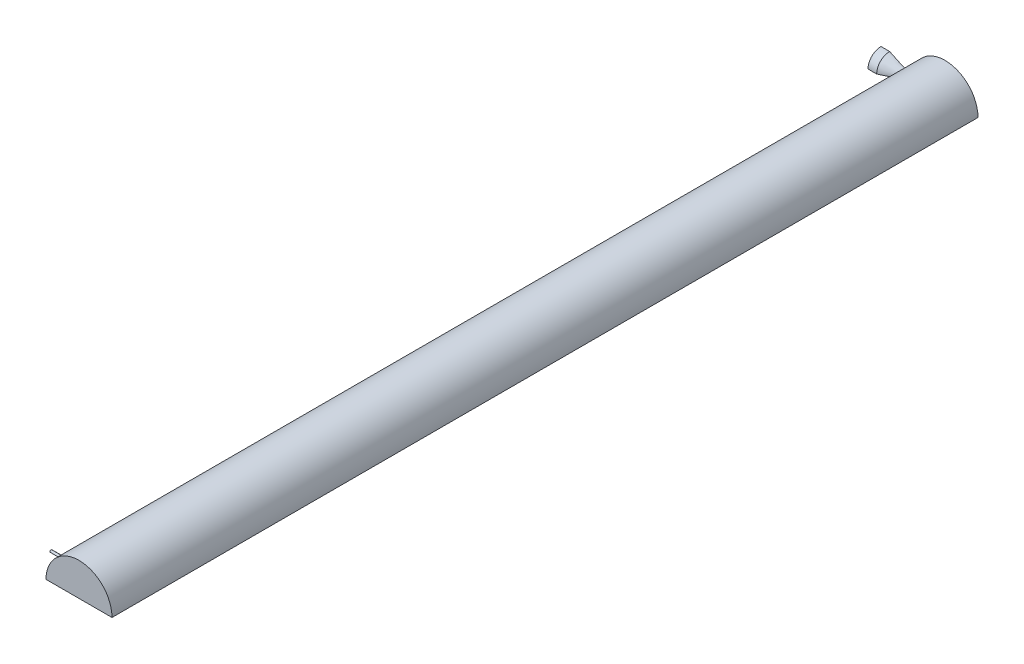
ISO-10303-21;
HEADER;
FILE_DESCRIPTION(('STEP AP214'),'2;1');
FILE_NAME('part.step','',(''),(''),'','','');
FILE_SCHEMA(('AUTOMOTIVE_DESIGN { 1 0 10303 214 1 1 1 1 }'));
ENDSEC;
DATA;
#1=APPLICATION_CONTEXT('core data for automotive mechanical design processes');
#2=APPLICATION_PROTOCOL_DEFINITION('international standard','automotive_design',2000,#1);
#3=PRODUCT_CONTEXT('',#1,'mechanical');
#4=PRODUCT('Part','Part','',(#3));
#5=PRODUCT_RELATED_PRODUCT_CATEGORY('part','',(#4));
#6=PRODUCT_DEFINITION_FORMATION('','',#4);
#7=PRODUCT_DEFINITION_CONTEXT('part definition',#1,'design');
#8=PRODUCT_DEFINITION('design','',#6,#7);
#9=PRODUCT_DEFINITION_SHAPE('','',#8);
#10=(LENGTH_UNIT() NAMED_UNIT(*) SI_UNIT(.MILLI.,.METRE.));
#11=(NAMED_UNIT(*) PLANE_ANGLE_UNIT() SI_UNIT($,.RADIAN.));
#12=(NAMED_UNIT(*) SI_UNIT($,.STERADIAN.) SOLID_ANGLE_UNIT());
#13=UNCERTAINTY_MEASURE_WITH_UNIT(LENGTH_MEASURE(1.E-05),#10,'distance_accuracy_value','');
#14=(GEOMETRIC_REPRESENTATION_CONTEXT(3) GLOBAL_UNCERTAINTY_ASSIGNED_CONTEXT((#13)) GLOBAL_UNIT_ASSIGNED_CONTEXT((#10,
#11,#12)) REPRESENTATION_CONTEXT('',''));
#15=CARTESIAN_POINT('',(0.,0.,0.));
#16=DIRECTION('',(0.,0.,1.));
#17=DIRECTION('',(1.,0.,0.));
#18=AXIS2_PLACEMENT_3D('',#15,#16,#17);
#19=CARTESIAN_POINT('',(-10.6541824341614,0.,15.0199999998294));
#20=DIRECTION('',(1.,0.,0.));
#21=DIRECTION('',(0.,1.,0.));
#22=AXIS2_PLACEMENT_3D('',#19,#20,#21);
#23=PLANE('',#22);
#24=CARTESIAN_POINT('',(-10.6541824341614,0.,0.));
#25=DIRECTION('',(-1.,0.,0.));
#26=DIRECTION('',(0.,-1.,0.));
#27=AXIS2_PLACEMENT_3D('',#24,#25,#26);
#28=CIRCLE('',#27,15.0199999998294);
#29=CARTESIAN_POINT('',(-10.6541824341614,0.,15.0199999998294));
#30=VERTEX_POINT('',#29);
#31=CARTESIAN_POINT('',(-10.6541824341614,15.0199999998294,0.));
#32=VERTEX_POINT('',#31);
#33=EDGE_CURVE('E48',#30,#32,#28,.T.);
#34=ORIENTED_EDGE('',*,*,#33,.T.);
#35=DIRECTION('',(0.,-1.,0.));
#36=VECTOR('',#35,1.);
#37=CARTESIAN_POINT('',(-10.6541824341614,15.0199999998294,0.));
#38=LINE('',#37,#36);
#39=CARTESIAN_POINT('',(-10.6541824341614,0.,0.));
#40=VERTEX_POINT('',#39);
#41=EDGE_CURVE('E166',#32,#40,#38,.T.);
#42=ORIENTED_EDGE('',*,*,#41,.T.);
#43=DIRECTION('',(0.,0.,-1.));
#44=VECTOR('',#43,1.);
#45=CARTESIAN_POINT('',(-10.6541824341614,0.,15.0199999998294));
#46=LINE('',#45,#44);
#47=EDGE_CURVE('E168',#30,#40,#46,.T.);
#48=ORIENTED_EDGE('',*,*,#47,.F.);
#49=EDGE_LOOP('',(#34,#42,#48));
#50=FACE_BOUND('',#49,.T.);
#51=ADVANCED_FACE('F35',(#50),#23,.F.);
#52=CARTESIAN_POINT('',(0.,0.,0.));
#53=DIRECTION('',(-1.,0.,0.));
#54=DIRECTION('',(0.,-1.,0.));
#55=AXIS2_PLACEMENT_3D('',#52,#53,#54);
#56=CYLINDRICAL_SURFACE('',#55,15.0199999997248);
#57=CARTESIAN_POINT('',(-0.654182433727519,0.,0.));
#58=DIRECTION('',(-1.,0.,0.));
#59=DIRECTION('',(0.,-1.,0.));
#60=AXIS2_PLACEMENT_3D('',#57,#58,#59);
#61=CIRCLE('',#60,15.0199999996203);
#62=CARTESIAN_POINT('',(-0.654182433727519,0.,15.0199999996203));
#63=VERTEX_POINT('',#62);
#64=CARTESIAN_POINT('',(-0.654182433727519,15.0199999996203,0.));
#65=VERTEX_POINT('',#64);
#66=EDGE_CURVE('E171',#63,#65,#61,.T.);
#67=ORIENTED_EDGE('',*,*,#66,.T.);
#68=DIRECTION('',(-1.,0.,0.));
#69=VECTOR('',#68,1.);
#70=CARTESIAN_POINT('',(-0.65418243416139,15.0199999998294,0.));
#71=LINE('',#70,#69);
#72=EDGE_CURVE('E173',#65,#32,#71,.T.);
#73=ORIENTED_EDGE('',*,*,#72,.T.);
#74=ORIENTED_EDGE('',*,*,#33,.F.);
#75=DIRECTION('',(-1.,0.,0.));
#76=VECTOR('',#75,1.);
#77=CARTESIAN_POINT('',(-0.65418243416139,0.,15.0199999998294));
#78=LINE('',#77,#76);
#79=EDGE_CURVE('E186',#63,#30,#78,.T.);
#80=ORIENTED_EDGE('',*,*,#79,.F.);
#81=EDGE_LOOP('',(#67,#73,#74,#80));
#82=FACE_BOUND('',#81,.T.);
#83=ADVANCED_FACE('F155',(#82),#56,.T.);
#84=CARTESIAN_POINT('',(25.4000000001663,0.,4.50000000000144));
#85=CARTESIAN_POINT('',(25.3598892369349,0.,4.49766910880118));
#86=CARTESIAN_POINT('',(25.2793812236262,0.,4.49375722895618));
#87=CARTESIAN_POINT('',(25.1247014310143,0.,4.48821861080727));
#88=CARTESIAN_POINT('',(24.9185956291807,0.,4.48540205418157));
#89=CARTESIAN_POINT('',(24.669284767566,0.,4.48881344717539));
#90=CARTESIAN_POINT('',(24.3542772353756,0.,4.50362498326314));
#91=CARTESIAN_POINT('',(23.9540913952493,0.,4.53807247092198));
#92=CARTESIAN_POINT('',(23.4644926829741,0.,4.6056330484024));
#93=CARTESIAN_POINT('',(22.8970359564531,0.,4.71029829721143));
#94=CARTESIAN_POINT('',(22.2155910122414,0.,4.87093447759818));
#95=CARTESIAN_POINT('',(21.3941677703144,0.,5.10357874497299));
#96=CARTESIAN_POINT('',(20.2387943291148,0.,5.48620744414766));
#97=CARTESIAN_POINT('',(18.7555681400774,0.,6.04420734604229));
#98=CARTESIAN_POINT('',(16.9507618636853,0.,6.79193377986655));
#99=CARTESIAN_POINT('',(14.9441194234548,0.,7.66978709691856));
#100=CARTESIAN_POINT('',(12.8108352821432,0.,8.63757914985836));
#101=CARTESIAN_POINT('',(10.7908859868668,0.,9.57062971311794));
#102=CARTESIAN_POINT('',(8.6069164760832,0.,10.5958925304816));
#103=CARTESIAN_POINT('',(6.70161347793502,0.,11.4959941901035));
#104=CARTESIAN_POINT('',(4.34709546986782,0.,12.6191359749948));
#105=CARTESIAN_POINT('',(2.74095302003808,0.,13.3865455831407));
#106=CARTESIAN_POINT('',(0.610598488645964,0.,14.4109823752598));
#107=CARTESIAN_POINT('',(-0.219836229306919,0.,14.8107043715923));
#108=CARTESIAN_POINT('',(-0.654182433727519,0.,15.0199999996203));
#109=B_SPLINE_CURVE_WITH_KNOTS('',4,(#84,#85,#86,#87,#88,#89,#90,#91,#92,#93,#94,#95,#96,#97,
#98,#99,#100,#101,#102,#103,#104,#105,#106,#107,#108),.UNSPECIFIED.,.F.,.F.,(5,1,1,1,1,1,1,1,1,
1,1,1,1,1,1,1,1,1,1,1,1,5),(0.0837711383466936,0.0894580438699278,0.0951449494118813,
0.100831857128774,0.106518764845667,0.119305951784671,0.132954595217711,0.148282884432776,
0.165343636956093,0.187893612878861,0.215959045335083,0.250080574399926,0.309279050231924,
0.377522094918906,0.445765136876236,0.514008176525914,0.582251215893804,0.650494254504257,
0.718737291663222,0.786980329098938,0.855223366682504,0.923466404408107),.UNSPECIFIED.);
#110=CARTESIAN_POINT('',(0.,0.,0.));
#111=DIRECTION('',(-1.,0.,0.));
#112=AXIS1_PLACEMENT('',#110,#111);
#113=SURFACE_OF_REVOLUTION('',#109,#112);
#114=CARTESIAN_POINT('',(25.1333186502903,0.,4.48937976678184));
#115=VERTEX_POINT('',#114);
#116=EDGE_CURVE('E180',#115,#63,#109,.T.);
#117=ORIENTED_EDGE('',*,*,#116,.F.);
#118=CARTESIAN_POINT('',(25.1333186486835,0.,4.48937976674108));
#119=CARTESIAN_POINT('',(25.1333123550256,0.1262143194195,4.48939400196303));
#120=CARTESIAN_POINT('',(25.1339455997111,0.252425960385009,4.48407370155712));
#121=CARTESIAN_POINT('',(25.136445627307,0.503936919939426,4.46286737472985));
#122=CARTESIAN_POINT('',(25.1383123163836,0.629236307194562,4.44698215202919));
#123=CARTESIAN_POINT('',(25.1432311197821,0.877904463410625,4.40477150044536));
#124=CARTESIAN_POINT('',(25.1462819855788,1.00127512386031,4.3784570668842));
#125=CARTESIAN_POINT('',(25.1534812886473,1.24534490263722,4.31558787384773));
#126=CARTESIAN_POINT('',(25.1576297192382,1.36604403722118,4.27903317670476));
#127=CARTESIAN_POINT('',(25.1669088477268,1.60393928451326,4.19594397239583));
#128=CARTESIAN_POINT('',(25.1720397031774,1.72113483185601,4.14940786435253));
#129=CARTESIAN_POINT('',(25.1831412938393,1.95122406166274,4.0466779616435));
#130=CARTESIAN_POINT('',(25.1891123392547,2.06411613560019,3.99048059826683));
#131=CARTESIAN_POINT('',(25.2017229749343,2.28471734209653,3.86886866960248));
#132=CARTESIAN_POINT('',(25.2083622722944,2.39242871509671,3.80345813759634));
#133=CARTESIAN_POINT('',(25.2221286596426,2.60201278506277,3.66383715878138));
#134=CARTESIAN_POINT('',(25.2292559293507,2.70388330518784,3.58962346231934));
#135=CARTESIAN_POINT('',(25.2438270715484,2.90144501481282,3.43260884471517));
#136=CARTESIAN_POINT('',(25.2512721330366,2.99710886436673,3.34977363140406));
#137=CARTESIAN_POINT('',(25.2662439429768,3.18115834480224,3.1763184581309));
#138=CARTESIAN_POINT('',(25.273770720899,3.2695412440432,3.08569560224708));
#139=CARTESIAN_POINT('',(25.2886891123713,3.43835287396168,2.89733733700644));
#140=CARTESIAN_POINT('',(25.2960807473769,3.51878287634694,2.79960306915252));
#141=CARTESIAN_POINT('',(25.3105227741409,3.6711597889791,2.59765251525863));
#142=CARTESIAN_POINT('',(25.3175730438575,3.74310367835655,2.49343394099318));
#143=CARTESIAN_POINT('',(25.3311415089628,3.8780898455741,2.27905920335932));
#144=CARTESIAN_POINT('',(25.3376586217419,3.94111419218129,2.16889167771414));
#145=CARTESIAN_POINT('',(25.3499568254499,4.05762617328341,1.94358569240856));
#146=CARTESIAN_POINT('',(25.3557379187343,4.11111383829878,1.82844724865816));
#147=CARTESIAN_POINT('',(25.366392606407,4.20812253465652,1.59407604825388));
#148=CARTESIAN_POINT('',(25.3712667152201,4.25164921892208,1.47484565821117));
#149=CARTESIAN_POINT('',(25.3799675971631,4.32842950014587,1.23313239585469));
#150=CARTESIAN_POINT('',(25.3837946104571,4.36168545304644,1.11065027644656));
#151=CARTESIAN_POINT('',(25.3912889201898,4.42630515052261,0.825109905657071));
#152=CARTESIAN_POINT('',(25.3945441856774,4.45393314807813,0.661170473364432));
#153=CARTESIAN_POINT('',(25.3978110863391,4.48156657092486,0.41389127560465));
#154=CARTESIAN_POINT('',(25.3986307150297,4.48847627618719,0.331270443892983));
#155=CARTESIAN_POINT('',(25.3997254481384,4.49769255144093,0.165773338982595));
#156=CARTESIAN_POINT('',(25.400000582173,4.49999937179583,0.0828970799228661));
#157=CARTESIAN_POINT('',(25.3999999996373,4.4999999999707,0.));
#158=B_SPLINE_CURVE_WITH_KNOTS('',3,(#118,#119,#120,#121,#122,#123,#124,#125,#126,#127,#128,
#129,#130,#131,#132,#133,#134,#135,#136,#137,#138,#139,#140,#141,#142,#143,#144,#145,#146,#147,
#148,#149,#150,#151,#152,#153,#154,#155,#156,#157),.UNSPECIFIED.,.F.,.F.,(4,2,2,2,2,2,2,2,2,2,2,
2,2,2,2,2,2,2,2,4),(0.,0.378525374275452,0.757021955732911,1.13512055231062,1.513216847457,
1.89137382931499,2.26967079754075,2.64780266912708,3.02607456355091,3.40591312288217,
3.7858935457469,4.16581310925721,4.54586751020474,4.92667541146833,5.30748209400269,
5.68807212729605,6.06857479433959,6.56624089286617,6.81487161468317,7.06348881242718),.UNSPECIFIED.);
#159=CARTESIAN_POINT('',(25.399999999638,4.49999999997665,0.));
#160=VERTEX_POINT('',#159);
#161=EDGE_CURVE('E123',#115,#160,#158,.T.);
#162=ORIENTED_EDGE('',*,*,#161,.T.);
#163=CARTESIAN_POINT('',(25.4000000001663,4.50000000000144,0.));
#164=CARTESIAN_POINT('',(25.3598892369349,4.49766910880118,0.));
#165=CARTESIAN_POINT('',(25.2793812236262,4.49375722895618,0.));
#166=CARTESIAN_POINT('',(25.1247014310143,4.48821861080727,0.));
#167=CARTESIAN_POINT('',(24.9185956291807,4.48540205418157,0.));
#168=CARTESIAN_POINT('',(24.669284767566,4.48881344717539,0.));
#169=CARTESIAN_POINT('',(24.3542772353756,4.50362498326314,0.));
#170=CARTESIAN_POINT('',(23.9540913952493,4.53807247092198,0.));
#171=CARTESIAN_POINT('',(23.4644926829741,4.6056330484024,0.));
#172=CARTESIAN_POINT('',(22.8970359564531,4.71029829721143,0.));
#173=CARTESIAN_POINT('',(22.2155910122414,4.87093447759818,0.));
#174=CARTESIAN_POINT('',(21.3941677703144,5.10357874497299,0.));
#175=CARTESIAN_POINT('',(20.2387943291148,5.48620744414766,0.));
#176=CARTESIAN_POINT('',(18.7555681400774,6.04420734604229,0.));
#177=CARTESIAN_POINT('',(16.9507618636853,6.79193377986655,0.));
#178=CARTESIAN_POINT('',(14.9441194234548,7.66978709691856,0.));
#179=CARTESIAN_POINT('',(12.8108352821432,8.63757914985836,0.));
#180=CARTESIAN_POINT('',(10.7908859868668,9.57062971311794,0.));
#181=CARTESIAN_POINT('',(8.6069164760832,10.5958925304816,0.));
#182=CARTESIAN_POINT('',(6.70161347793502,11.4959941901035,0.));
#183=CARTESIAN_POINT('',(4.34709546986782,12.6191359749948,0.));
#184=CARTESIAN_POINT('',(2.74095302003808,13.3865455831407,0.));
#185=CARTESIAN_POINT('',(0.610598488645964,14.4109823752598,0.));
#186=CARTESIAN_POINT('',(-0.219836229306919,14.8107043715923,0.));
#187=CARTESIAN_POINT('',(-0.654182433727519,15.0199999996203,0.));
#188=B_SPLINE_CURVE_WITH_KNOTS('',4,(#163,#164,#165,#166,#167,#168,#169,#170,#171,#172,#173,
#174,#175,#176,#177,#178,#179,#180,#181,#182,#183,#184,#185,#186,#187),.UNSPECIFIED.,.F.,.F.,(5,
1,1,1,1,1,1,1,1,1,1,1,1,1,1,1,1,1,1,1,1,5),(0.0837711383466936,0.0894580438699278,
0.0951449494118813,0.100831857128774,0.106518764845667,0.119305951784671,0.132954595217711,
0.148282884432776,0.165343636956093,0.187893612878861,0.215959045335083,0.250080574399926,
0.309279050231924,0.377522094918906,0.445765136876236,0.514008176525914,0.582251215893804,
0.650494254504257,0.718737291663222,0.786980329098938,0.855223366682504,0.923466404408107),.UNSPECIFIED.);
#189=EDGE_CURVE('E132',#160,#65,#188,.T.);
#190=ORIENTED_EDGE('',*,*,#189,.T.);
#191=ORIENTED_EDGE('',*,*,#66,.F.);
#192=EDGE_LOOP('',(#117,#162,#190,#191));
#193=FACE_BOUND('',#192,.T.);
#194=ADVANCED_FACE('F136',(#193),#113,.T.);
#195=CARTESIAN_POINT('',(12.1131651748484,0.,8.96149231744127));
#196=DIRECTION('',(0.,1.,0.));
#197=DIRECTION('',(-1.,0.,0.));
#198=AXIS2_PLACEMENT_3D('',#195,#196,#197);
#199=PLANE('',#198);
#200=DIRECTION('',(-1.,0.,0.));
#201=VECTOR('',#200,1.);
#202=CARTESIAN_POINT('',(50.,0.,967.503760296632));
#203=LINE('',#202,#201);
#204=CARTESIAN_POINT('',(25.1333186486835,0.,967.503760296632));
#205=VERTEX_POINT('',#204);
#206=CARTESIAN_POINT('',(0.,0.,967.503760296632));
#207=VERTEX_POINT('',#206);
#208=EDGE_CURVE('E55',#205,#207,#203,.T.);
#209=ORIENTED_EDGE('',*,*,#208,.F.);
#210=DIRECTION('',(0.,0.,-1.));
#211=VECTOR('',#210,1.);
#212=CARTESIAN_POINT('',(25.1333186486835,0.,1000.));
#213=LINE('',#212,#211);
#214=EDGE_CURVE('E59',#205,#115,#213,.T.);
#215=ORIENTED_EDGE('',*,*,#214,.T.);
#216=ORIENTED_EDGE('',*,*,#116,.T.);
#217=ORIENTED_EDGE('',*,*,#79,.T.);
#218=ORIENTED_EDGE('',*,*,#47,.T.);
#219=DIRECTION('',(1.,0.,0.));
#220=VECTOR('',#219,1.);
#221=CARTESIAN_POINT('',(0.,0.,0.));
#222=LINE('',#221,#220);
#223=CARTESIAN_POINT('',(101.333318648683,0.,0.));
#224=VERTEX_POINT('',#223);
#225=EDGE_CURVE('E178',#40,#224,#222,.T.);
#226=ORIENTED_EDGE('',*,*,#225,.T.);
#227=DIRECTION('',(0.,0.,-1.));
#228=VECTOR('',#227,1.);
#229=CARTESIAN_POINT('',(101.333318648683,0.,1000.));
#230=LINE('',#229,#228);
#231=CARTESIAN_POINT('',(101.333318648683,0.,1000.));
#232=VERTEX_POINT('',#231);
#233=EDGE_CURVE('E118',#232,#224,#230,.T.);
#234=ORIENTED_EDGE('',*,*,#233,.F.);
#235=DIRECTION('',(1.,0.,0.));
#236=VECTOR('',#235,1.);
#237=CARTESIAN_POINT('',(25.1333186486835,0.,1000.));
#238=LINE('',#237,#236);
#239=CARTESIAN_POINT('',(25.1333186486835,0.,1000.));
#240=VERTEX_POINT('',#239);
#241=EDGE_CURVE('E116',#240,#232,#238,.T.);
#242=ORIENTED_EDGE('',*,*,#241,.F.);
#243=CARTESIAN_POINT('',(25.1333186486835,0.,970.507760296632));
#244=VERTEX_POINT('',#243);
#245=EDGE_CURVE('E121',#240,#244,#213,.T.);
#246=ORIENTED_EDGE('',*,*,#245,.T.);
#247=DIRECTION('',(-1.,0.,0.));
#248=VECTOR('',#247,1.);
#249=CARTESIAN_POINT('',(50.,0.,970.507760296632));
#250=LINE('',#249,#248);
#251=CARTESIAN_POINT('',(0.,0.,970.507760296632));
#252=VERTEX_POINT('',#251);
#253=EDGE_CURVE('E101',#244,#252,#250,.T.);
#254=ORIENTED_EDGE('',*,*,#253,.T.);
#255=DIRECTION('',(0.,0.,1.));
#256=VECTOR('',#255,1.);
#257=CARTESIAN_POINT('',(0.,0.,967.503760296632));
#258=LINE('',#257,#256);
#259=EDGE_CURVE('E102',#207,#252,#258,.T.);
#260=ORIENTED_EDGE('',*,*,#259,.F.);
#261=EDGE_LOOP('',(#209,#215,#216,#217,#218,#226,#234,#242,#246,#254,#260));
#262=FACE_BOUND('',#261,.T.);
#263=ADVANCED_FACE('F107',(#262),#199,.F.);
#264=CARTESIAN_POINT('',(12.1131651748484,8.96149231744127,0.));
#265=DIRECTION('',(0.,0.,-1.));
#266=DIRECTION('',(-1.,0.,0.));
#267=AXIS2_PLACEMENT_3D('',#264,#265,#266);
#268=PLANE('',#267);
#269=ORIENTED_EDGE('',*,*,#189,.F.);
#270=CARTESIAN_POINT('',(63.2333186486835,0.,0.));
#271=DIRECTION('',(0.,0.,-1.));
#272=DIRECTION('',(-1.,0.,0.));
#273=AXIS2_PLACEMENT_3D('',#270,#271,#272);
#274=CIRCLE('',#273,38.1);
#275=EDGE_CURVE('E111',#160,#224,#274,.T.);
#276=ORIENTED_EDGE('',*,*,#275,.T.);
#277=ORIENTED_EDGE('',*,*,#225,.F.);
#278=ORIENTED_EDGE('',*,*,#41,.F.);
#279=ORIENTED_EDGE('',*,*,#72,.F.);
#280=EDGE_LOOP('',(#269,#276,#277,#278,#279));
#281=FACE_BOUND('',#280,.T.);
#282=ADVANCED_FACE('F146',(#281),#268,.T.);
#283=CARTESIAN_POINT('',(63.2333186486835,0.,1000.));
#284=DIRECTION('',(0.,0.,-1.));
#285=DIRECTION('',(-1.,0.,0.));
#286=AXIS2_PLACEMENT_3D('',#283,#284,#285);
#287=CYLINDRICAL_SURFACE('',#286,38.1);
#288=CARTESIAN_POINT('',(25.1333186486835,0.,970.507760296632));
#289=CARTESIAN_POINT('',(25.1333182553512,0.0422398606277258,970.50776003559));
#290=CARTESIAN_POINT('',(25.133388982496,0.0844594684019537,970.505977348615));
#291=CARTESIAN_POINT('',(25.1336685076578,0.16859626577595,970.498865612055));
#292=CARTESIAN_POINT('',(25.1338772986687,0.21051347061223,970.493536742423));
#293=CARTESIAN_POINT('',(25.1347036261717,0.335289511059845,970.472281414842));
#294=CARTESIAN_POINT('',(25.135521143695,0.417312003896581,970.451086098843));
#295=CARTESIAN_POINT('',(25.1375988135623,0.576627310799031,970.39523618927));
#296=CARTESIAN_POINT('',(25.138859165228,0.653917976619226,970.360575534135));
#297=CARTESIAN_POINT('',(25.1416801641367,0.801580716659718,970.278784391292));
#298=CARTESIAN_POINT('',(25.1432407559147,0.871954065130013,970.231656206173));
#299=CARTESIAN_POINT('',(25.1464876348223,1.00382562407265,970.126237452259));
#300=CARTESIAN_POINT('',(25.1481739850644,1.06531933218841,970.067941255415));
#301=CARTESIAN_POINT('',(25.1514819858821,1.17765985270179,969.941843678761));
#302=CARTESIAN_POINT('',(25.1531036265682,1.22850504267601,969.874040853131));
#303=CARTESIAN_POINT('',(25.1560995458439,1.31810594210997,969.730837356239));
#304=CARTESIAN_POINT('',(25.1574737543821,1.3568582301742,969.655434542713));
#305=CARTESIAN_POINT('',(25.159819001506,1.42114931379798,969.499191507489));
#306=CARTESIAN_POINT('',(25.1607900671682,1.44668899679656,969.418351651388));
#307=CARTESIAN_POINT('',(25.1622190569565,1.48382096076027,969.253568359257));
#308=CARTESIAN_POINT('',(25.1626772405075,1.49542029322231,969.169626514485));
#309=CARTESIAN_POINT('',(25.1630295820409,1.50436410571496,969.000983864415));
#310=CARTESIAN_POINT('',(25.1629237292159,1.50170831260658,968.916283044604));
#311=CARTESIAN_POINT('',(25.1621601568424,1.48222267104647,968.748579378383));
#312=CARTESIAN_POINT('',(25.1615027503074,1.46540086196305,968.665575596246));
#313=CARTESIAN_POINT('',(25.1597106702372,1.4180731933469,968.503571343374));
#314=CARTESIAN_POINT('',(25.1585759973311,1.38756735185125,968.424570867364));
#315=CARTESIAN_POINT('',(25.155956895465,1.31372766189964,968.272787921017));
#316=CARTESIAN_POINT('',(25.1544723588965,1.27038986563496,968.200007373163));
#317=CARTESIAN_POINT('',(25.1513210717637,1.17212144924475,968.062755238929));
#318=CARTESIAN_POINT('',(25.1496543292096,1.11719133864166,967.998283287558));
#319=CARTESIAN_POINT('',(25.1463252932929,0.997261160485742,967.879436323473));
#320=CARTESIAN_POINT('',(25.1446630028663,0.932255595549175,967.825066858715));
#321=CARTESIAN_POINT('',(25.1415305765067,0.794010584240436,967.727994648878));
#322=CARTESIAN_POINT('',(25.1400605013689,0.720768546338876,967.685295590361));
#323=CARTESIAN_POINT('',(25.1374780113914,0.568117170780115,967.612778924976));
#324=CARTESIAN_POINT('',(25.1363658199836,0.488704018662689,967.58296936123));
#325=CARTESIAN_POINT('',(25.1346274700357,0.326056311255945,967.537153359133));
#326=CARTESIAN_POINT('',(25.134000570471,0.242827788592397,967.521125871847));
#327=CARTESIAN_POINT('',(25.1335398765969,0.132534732975121,967.509381733568));
#328=CARTESIAN_POINT('',(25.1334569594551,0.106048410656292,967.507272590288));
#329=CARTESIAN_POINT('',(25.1333464187653,0.053044983369923,967.504463793876));
#330=CARTESIAN_POINT('',(25.133318703839,0.0265280020982022,967.503761811402));
#331=CARTESIAN_POINT('',(25.1333186486835,0.,967.503760296632));
#332=B_SPLINE_CURVE_WITH_KNOTS('',3,(#288,#289,#290,#291,#292,#293,#294,#295,#296,#297,#298,
#299,#300,#301,#302,#303,#304,#305,#306,#307,#308,#309,#310,#311,#312,#313,#314,#315,#316,#317,
#318,#319,#320,#321,#322,#323,#324,#325,#326,#327,#328,#329,#330,#331),.UNSPECIFIED.,.F.,.F.,(4,
2,2,2,2,2,2,2,2,2,2,2,2,2,2,2,2,2,2,2,2,4),(0.,0.126641696577556,0.253276967139264,
0.506135133947968,0.759107259617463,1.01203269721271,1.2650859318421,1.51817769401902,
1.77134099763178,2.02448729504669,2.27750548860557,2.53052853020189,2.78340807516004,
3.03628728679558,3.28924437884127,3.54219035485967,3.79527483264653,4.04843916508759,
4.30176124640059,4.55469574613401,4.63438043086644,4.71393310037496),.UNSPECIFIED.);
#333=EDGE_CURVE('E11',#244,#205,#332,.T.);
#334=ORIENTED_EDGE('',*,*,#333,.F.);
#335=ORIENTED_EDGE('',*,*,#245,.F.);
#336=CARTESIAN_POINT('',(63.2333186486835,0.,1000.));
#337=DIRECTION('',(0.,0.,-1.));
#338=DIRECTION('',(-1.,0.,0.));
#339=AXIS2_PLACEMENT_3D('',#336,#337,#338);
#340=CIRCLE('',#339,38.1);
#341=EDGE_CURVE('E113',#240,#232,#340,.T.);
#342=ORIENTED_EDGE('',*,*,#341,.T.);
#343=ORIENTED_EDGE('',*,*,#233,.T.);
#344=ORIENTED_EDGE('',*,*,#275,.F.);
#345=ORIENTED_EDGE('',*,*,#161,.F.);
#346=ORIENTED_EDGE('',*,*,#214,.F.);
#347=EDGE_LOOP('',(#334,#335,#342,#343,#344,#345,#346));
#348=FACE_BOUND('',#347,.T.);
#349=ADVANCED_FACE('F140',(#348),#287,.T.);
#350=CARTESIAN_POINT('',(63.2333186486835,0.,1000.));
#351=DIRECTION('',(0.,0.,-1.));
#352=DIRECTION('',(-1.,0.,0.));
#353=AXIS2_PLACEMENT_3D('',#350,#351,#352);
#354=PLANE('',#353);
#355=ORIENTED_EDGE('',*,*,#341,.F.);
#356=ORIENTED_EDGE('',*,*,#241,.T.);
#357=EDGE_LOOP('',(#355,#356));
#358=FACE_BOUND('',#357,.T.);
#359=ADVANCED_FACE('F145',(#358),#354,.F.);
#360=CARTESIAN_POINT('',(50.,0.,969.005760296632));
#361=DIRECTION('',(-1.,0.,0.));
#362=DIRECTION('',(0.,0.,1.));
#363=AXIS2_PLACEMENT_3D('',#360,#361,#362);
#364=CYLINDRICAL_SURFACE('',#363,1.502);
#365=ORIENTED_EDGE('',*,*,#253,.F.);
#366=ORIENTED_EDGE('',*,*,#333,.T.);
#367=ORIENTED_EDGE('',*,*,#208,.T.);
#368=CARTESIAN_POINT('',(0.,0.,969.005760296632));
#369=DIRECTION('',(-1.,0.,0.));
#370=DIRECTION('',(0.,0.,1.));
#371=AXIS2_PLACEMENT_3D('',#368,#369,#370);
#372=CIRCLE('',#371,1.502);
#373=EDGE_CURVE('E98',#252,#207,#372,.T.);
#374=ORIENTED_EDGE('',*,*,#373,.F.);
#375=EDGE_LOOP('',(#365,#366,#367,#374));
#376=FACE_BOUND('',#375,.T.);
#377=ADVANCED_FACE('F97',(#376),#364,.T.);
#378=CARTESIAN_POINT('',(0.,0.,969.005760296632));
#379=DIRECTION('',(-1.,0.,0.));
#380=DIRECTION('',(0.,0.,1.));
#381=AXIS2_PLACEMENT_3D('',#378,#379,#380);
#382=PLANE('',#381);
#383=ORIENTED_EDGE('',*,*,#373,.T.);
#384=ORIENTED_EDGE('',*,*,#259,.T.);
#385=EDGE_LOOP('',(#383,#384));
#386=FACE_BOUND('',#385,.T.);
#387=ADVANCED_FACE('F105',(#386),#382,.T.);
#388=CLOSED_SHELL('',(#51,#83,#194,#263,#282,#349,#359,#377,#387));
#389=MANIFOLD_SOLID_BREP('B2',#388);
#390=ADVANCED_BREP_SHAPE_REPRESENTATION('',(#18,#389),#14);
#391=SHAPE_DEFINITION_REPRESENTATION(#9,#390);
ENDSEC;
END-ISO-10303-21;
